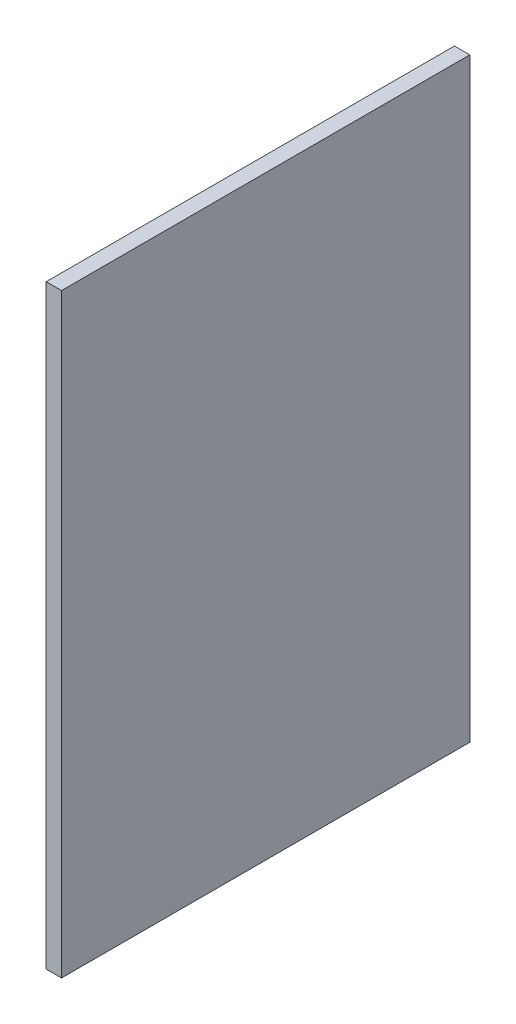
ISO-10303-21;
HEADER;
FILE_DESCRIPTION(('STEP AP214'),'2;1');
FILE_NAME('part.step','',(''),(''),'','','');
FILE_SCHEMA(('AUTOMOTIVE_DESIGN { 1 0 10303 214 1 1 1 1 }'));
ENDSEC;
DATA;
#1=APPLICATION_CONTEXT('core data for automotive mechanical design processes');
#2=APPLICATION_PROTOCOL_DEFINITION('international standard','automotive_design',2000,#1);
#3=PRODUCT_CONTEXT('',#1,'mechanical');
#4=PRODUCT('Part','Part','',(#3));
#5=PRODUCT_RELATED_PRODUCT_CATEGORY('part','',(#4));
#6=PRODUCT_DEFINITION_FORMATION('','',#4);
#7=PRODUCT_DEFINITION_CONTEXT('part definition',#1,'design');
#8=PRODUCT_DEFINITION('design','',#6,#7);
#9=PRODUCT_DEFINITION_SHAPE('','',#8);
#10=(LENGTH_UNIT() NAMED_UNIT(*) SI_UNIT(.MILLI.,.METRE.));
#11=(NAMED_UNIT(*) PLANE_ANGLE_UNIT() SI_UNIT($,.RADIAN.));
#12=(NAMED_UNIT(*) SI_UNIT($,.STERADIAN.) SOLID_ANGLE_UNIT());
#13=UNCERTAINTY_MEASURE_WITH_UNIT(LENGTH_MEASURE(1.E-05),#10,'distance_accuracy_value','');
#14=(GEOMETRIC_REPRESENTATION_CONTEXT(3) GLOBAL_UNCERTAINTY_ASSIGNED_CONTEXT((#13)) GLOBAL_UNIT_ASSIGNED_CONTEXT((#10,
#11,#12)) REPRESENTATION_CONTEXT('',''));
#15=CARTESIAN_POINT('',(0.,0.,0.));
#16=DIRECTION('',(0.,0.,1.));
#17=DIRECTION('',(1.,0.,0.));
#18=AXIS2_PLACEMENT_3D('',#15,#16,#17);
#19=CARTESIAN_POINT('',(18.,-655.890394931058,-445.496486701628));
#20=DIRECTION('',(0.,0.,1.));
#21=DIRECTION('',(1.,0.,0.));
#22=AXIS2_PLACEMENT_3D('',#19,#20,#21);
#23=PLANE('',#22);
#24=DIRECTION('',(0.,1.,0.));
#25=VECTOR('',#24,1.);
#26=CARTESIAN_POINT('',(0.,-655.890394931058,-445.496486701628));
#27=LINE('',#26,#25);
#28=CARTESIAN_POINT('',(0.,-655.890394931058,-445.496486701628));
#29=VERTEX_POINT('',#28);
#30=CARTESIAN_POINT('',(0.,44.109605068942,-445.496486701628));
#31=VERTEX_POINT('',#30);
#32=EDGE_CURVE('E98',#29,#31,#27,.T.);
#33=ORIENTED_EDGE('',*,*,#32,.T.);
#34=DIRECTION('',(-1.,0.,0.));
#35=VECTOR('',#34,1.);
#36=CARTESIAN_POINT('',(18.,44.109605068942,-445.496486701628));
#37=LINE('',#36,#35);
#38=CARTESIAN_POINT('',(18.,44.109605068942,-445.496486701628));
#39=VERTEX_POINT('',#38);
#40=EDGE_CURVE('E11',#39,#31,#37,.T.);
#41=ORIENTED_EDGE('',*,*,#40,.F.);
#42=DIRECTION('',(0.,1.,0.));
#43=VECTOR('',#42,1.);
#44=CARTESIAN_POINT('',(18.,-655.890394931058,-445.496486701628));
#45=LINE('',#44,#43);
#46=CARTESIAN_POINT('',(18.,-655.890394931058,-445.496486701628));
#47=VERTEX_POINT('',#46);
#48=EDGE_CURVE('E86',#47,#39,#45,.T.);
#49=ORIENTED_EDGE('',*,*,#48,.F.);
#50=DIRECTION('',(-1.,0.,0.));
#51=VECTOR('',#50,1.);
#52=CARTESIAN_POINT('',(18.,-655.890394931058,-445.496486701628));
#53=LINE('',#52,#51);
#54=EDGE_CURVE('E94',#47,#29,#53,.T.);
#55=ORIENTED_EDGE('',*,*,#54,.T.);
#56=EDGE_LOOP('',(#33,#41,#49,#55));
#57=FACE_BOUND('',#56,.T.);
#58=ADVANCED_FACE('F35',(#57),#23,.F.);
#59=CARTESIAN_POINT('',(18.,44.109605068942,-445.496486701628));
#60=DIRECTION('',(0.,-1.,0.));
#61=DIRECTION('',(0.,0.,-1.));
#62=AXIS2_PLACEMENT_3D('',#59,#60,#61);
#63=PLANE('',#62);
#64=DIRECTION('',(0.,0.,1.));
#65=VECTOR('',#64,1.);
#66=CARTESIAN_POINT('',(0.,44.109605068942,-445.496486701628));
#67=LINE('',#66,#65);
#68=CARTESIAN_POINT('',(0.,44.1096050689419,34.5035132983724));
#69=VERTEX_POINT('',#68);
#70=EDGE_CURVE('E90',#31,#69,#67,.T.);
#71=ORIENTED_EDGE('',*,*,#70,.T.);
#72=DIRECTION('',(-1.,0.,0.));
#73=VECTOR('',#72,1.);
#74=CARTESIAN_POINT('',(18.,44.1096050689419,34.5035132983724));
#75=LINE('',#74,#73);
#76=CARTESIAN_POINT('',(18.,44.1096050689419,34.5035132983724));
#77=VERTEX_POINT('',#76);
#78=EDGE_CURVE('E43',#77,#69,#75,.T.);
#79=ORIENTED_EDGE('',*,*,#78,.F.);
#80=DIRECTION('',(0.,0.,1.));
#81=VECTOR('',#80,1.);
#82=CARTESIAN_POINT('',(18.,44.109605068942,-445.496486701628));
#83=LINE('',#82,#81);
#84=EDGE_CURVE('E81',#39,#77,#83,.T.);
#85=ORIENTED_EDGE('',*,*,#84,.F.);
#86=ORIENTED_EDGE('',*,*,#40,.T.);
#87=EDGE_LOOP('',(#71,#79,#85,#86));
#88=FACE_BOUND('',#87,.T.);
#89=ADVANCED_FACE('F89',(#88),#63,.F.);
#90=CARTESIAN_POINT('',(18.,-655.890394931058,34.5035132983724));
#91=DIRECTION('',(0.,0.,-1.));
#92=DIRECTION('',(-1.,0.,0.));
#93=AXIS2_PLACEMENT_3D('',#90,#91,#92);
#94=PLANE('',#93);
#95=DIRECTION('',(0.,-1.,0.));
#96=VECTOR('',#95,1.);
#97=CARTESIAN_POINT('',(0.,-655.890394931058,34.5035132983724));
#98=LINE('',#97,#96);
#99=CARTESIAN_POINT('',(0.,-655.890394931058,34.5035132983724));
#100=VERTEX_POINT('',#99);
#101=EDGE_CURVE('E68',#69,#100,#98,.T.);
#102=ORIENTED_EDGE('',*,*,#101,.T.);
#103=DIRECTION('',(-1.,0.,0.));
#104=VECTOR('',#103,1.);
#105=CARTESIAN_POINT('',(18.,-655.890394931058,34.5035132983724));
#106=LINE('',#105,#104);
#107=CARTESIAN_POINT('',(18.,-655.890394931058,34.5035132983724));
#108=VERTEX_POINT('',#107);
#109=EDGE_CURVE('E91',#108,#100,#106,.T.);
#110=ORIENTED_EDGE('',*,*,#109,.F.);
#111=DIRECTION('',(0.,-1.,0.));
#112=VECTOR('',#111,1.);
#113=CARTESIAN_POINT('',(18.,-655.890394931058,34.5035132983724));
#114=LINE('',#113,#112);
#115=EDGE_CURVE('E84',#77,#108,#114,.T.);
#116=ORIENTED_EDGE('',*,*,#115,.F.);
#117=ORIENTED_EDGE('',*,*,#78,.T.);
#118=EDGE_LOOP('',(#102,#110,#116,#117));
#119=FACE_BOUND('',#118,.T.);
#120=ADVANCED_FACE('F92',(#119),#94,.F.);
#121=CARTESIAN_POINT('',(18.,-655.890394931058,-445.496486701628));
#122=DIRECTION('',(0.,1.,0.));
#123=DIRECTION('',(0.,0.,1.));
#124=AXIS2_PLACEMENT_3D('',#121,#122,#123);
#125=PLANE('',#124);
#126=DIRECTION('',(0.,0.,-1.));
#127=VECTOR('',#126,1.);
#128=CARTESIAN_POINT('',(0.,-655.890394931058,-445.496486701628));
#129=LINE('',#128,#127);
#130=EDGE_CURVE('E74',#100,#29,#129,.T.);
#131=ORIENTED_EDGE('',*,*,#130,.T.);
#132=ORIENTED_EDGE('',*,*,#54,.F.);
#133=DIRECTION('',(0.,0.,-1.));
#134=VECTOR('',#133,1.);
#135=CARTESIAN_POINT('',(18.,-655.890394931058,-445.496486701628));
#136=LINE('',#135,#134);
#137=EDGE_CURVE('E51',#108,#47,#136,.T.);
#138=ORIENTED_EDGE('',*,*,#137,.F.);
#139=ORIENTED_EDGE('',*,*,#109,.T.);
#140=EDGE_LOOP('',(#131,#132,#138,#139));
#141=FACE_BOUND('',#140,.T.);
#142=ADVANCED_FACE('F105',(#141),#125,.F.);
#143=CARTESIAN_POINT('',(18.,0.,0.));
#144=DIRECTION('',(1.,0.,0.));
#145=DIRECTION('',(0.,0.,-1.));
#146=AXIS2_PLACEMENT_3D('',#143,#144,#145);
#147=PLANE('',#146);
#148=ORIENTED_EDGE('',*,*,#48,.T.);
#149=ORIENTED_EDGE('',*,*,#84,.T.);
#150=ORIENTED_EDGE('',*,*,#115,.T.);
#151=ORIENTED_EDGE('',*,*,#137,.T.);
#152=EDGE_LOOP('',(#148,#149,#150,#151));
#153=FACE_BOUND('',#152,.T.);
#154=ADVANCED_FACE('F82',(#153),#147,.T.);
#155=CARTESIAN_POINT('',(0.,0.,0.));
#156=DIRECTION('',(1.,0.,0.));
#157=DIRECTION('',(0.,0.,-1.));
#158=AXIS2_PLACEMENT_3D('',#155,#156,#157);
#159=PLANE('',#158);
#160=ORIENTED_EDGE('',*,*,#32,.F.);
#161=ORIENTED_EDGE('',*,*,#130,.F.);
#162=ORIENTED_EDGE('',*,*,#101,.F.);
#163=ORIENTED_EDGE('',*,*,#70,.F.);
#164=EDGE_LOOP('',(#160,#161,#162,#163));
#165=FACE_BOUND('',#164,.T.);
#166=ADVANCED_FACE('F108',(#165),#159,.F.);
#167=CLOSED_SHELL('',(#58,#89,#120,#142,#154,#166));
#168=MANIFOLD_SOLID_BREP('B2',#167);
#169=ADVANCED_BREP_SHAPE_REPRESENTATION('',(#18,#168),#14);
#170=SHAPE_DEFINITION_REPRESENTATION(#9,#169);
ENDSEC;
END-ISO-10303-21;
